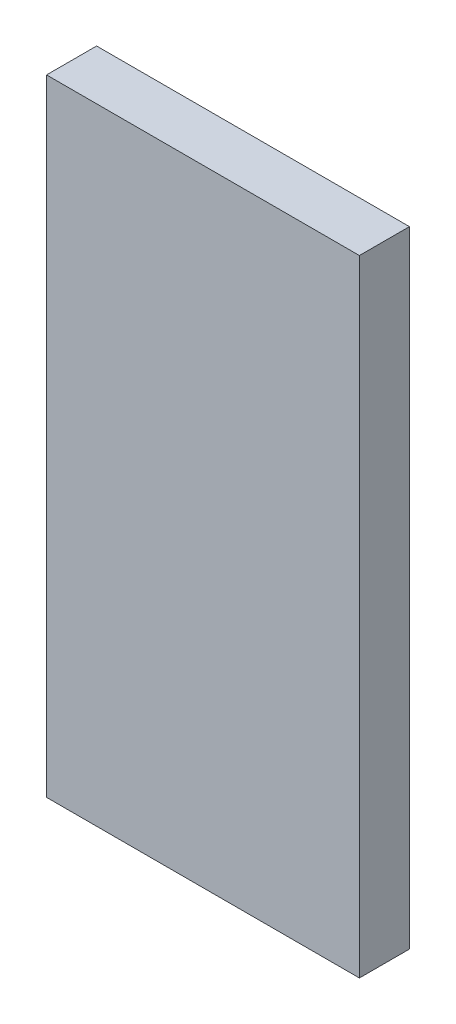
ISO-10303-21;
HEADER;
FILE_DESCRIPTION(('STEP AP214'),'2;1');
FILE_NAME('part.step','',(''),(''),'','','');
FILE_SCHEMA(('AUTOMOTIVE_DESIGN { 1 0 10303 214 1 1 1 1 }'));
ENDSEC;
DATA;
#1=APPLICATION_CONTEXT('core data for automotive mechanical design processes');
#2=APPLICATION_PROTOCOL_DEFINITION('international standard','automotive_design',2000,#1);
#3=PRODUCT_CONTEXT('',#1,'mechanical');
#4=PRODUCT('Part','Part','',(#3));
#5=PRODUCT_RELATED_PRODUCT_CATEGORY('part','',(#4));
#6=PRODUCT_DEFINITION_FORMATION('','',#4);
#7=PRODUCT_DEFINITION_CONTEXT('part definition',#1,'design');
#8=PRODUCT_DEFINITION('design','',#6,#7);
#9=PRODUCT_DEFINITION_SHAPE('','',#8);
#10=(LENGTH_UNIT() NAMED_UNIT(*) SI_UNIT(.MILLI.,.METRE.));
#11=(NAMED_UNIT(*) PLANE_ANGLE_UNIT() SI_UNIT($,.RADIAN.));
#12=(NAMED_UNIT(*) SI_UNIT($,.STERADIAN.) SOLID_ANGLE_UNIT());
#13=UNCERTAINTY_MEASURE_WITH_UNIT(LENGTH_MEASURE(1.E-05),#10,'distance_accuracy_value','');
#14=(GEOMETRIC_REPRESENTATION_CONTEXT(3) GLOBAL_UNCERTAINTY_ASSIGNED_CONTEXT((#13)) GLOBAL_UNIT_ASSIGNED_CONTEXT((#10,
#11,#12)) REPRESENTATION_CONTEXT('',''));
#15=CARTESIAN_POINT('',(0.,0.,0.));
#16=DIRECTION('',(0.,0.,1.));
#17=DIRECTION('',(1.,0.,0.));
#18=AXIS2_PLACEMENT_3D('',#15,#16,#17);
#19=CARTESIAN_POINT('',(2.5,5.00000000000001,0.8));
#20=DIRECTION('',(-1.,0.,0.));
#21=DIRECTION('',(0.,0.,1.));
#22=AXIS2_PLACEMENT_3D('',#19,#20,#21);
#23=PLANE('',#22);
#24=DIRECTION('',(0.,1.,0.));
#25=VECTOR('',#24,1.);
#26=CARTESIAN_POINT('',(2.5,5.00000000000001,0.));
#27=LINE('',#26,#25);
#28=CARTESIAN_POINT('',(2.5,-4.99999999999999,0.));
#29=VERTEX_POINT('',#28);
#30=CARTESIAN_POINT('',(2.5,5.00000000000001,0.));
#31=VERTEX_POINT('',#30);
#32=EDGE_CURVE('E100',#29,#31,#27,.T.);
#33=ORIENTED_EDGE('',*,*,#32,.T.);
#34=DIRECTION('',(0.,0.,-1.));
#35=VECTOR('',#34,1.);
#36=CARTESIAN_POINT('',(2.5,5.00000000000001,0.8));
#37=LINE('',#36,#35);
#38=CARTESIAN_POINT('',(2.5,5.00000000000001,0.8));
#39=VERTEX_POINT('',#38);
#40=EDGE_CURVE('E11',#39,#31,#37,.T.);
#41=ORIENTED_EDGE('',*,*,#40,.F.);
#42=DIRECTION('',(0.,1.,0.));
#43=VECTOR('',#42,1.);
#44=CARTESIAN_POINT('',(2.5,5.00000000000001,0.8));
#45=LINE('',#44,#43);
#46=CARTESIAN_POINT('',(2.5,-4.99999999999999,0.8));
#47=VERTEX_POINT('',#46);
#48=EDGE_CURVE('E88',#47,#39,#45,.T.);
#49=ORIENTED_EDGE('',*,*,#48,.F.);
#50=DIRECTION('',(0.,0.,-1.));
#51=VECTOR('',#50,1.);
#52=CARTESIAN_POINT('',(2.5,-4.99999999999999,0.8));
#53=LINE('',#52,#51);
#54=EDGE_CURVE('E96',#47,#29,#53,.T.);
#55=ORIENTED_EDGE('',*,*,#54,.T.);
#56=EDGE_LOOP('',(#33,#41,#49,#55));
#57=FACE_BOUND('',#56,.T.);
#58=ADVANCED_FACE('F37',(#57),#23,.F.);
#59=CARTESIAN_POINT('',(-2.50000000000001,5.00000000000001,0.8));
#60=DIRECTION('',(0.,-1.,0.));
#61=DIRECTION('',(0.,0.,-1.));
#62=AXIS2_PLACEMENT_3D('',#59,#60,#61);
#63=PLANE('',#62);
#64=DIRECTION('',(-1.,0.,0.));
#65=VECTOR('',#64,1.);
#66=CARTESIAN_POINT('',(-2.50000000000001,5.00000000000001,0.));
#67=LINE('',#66,#65);
#68=CARTESIAN_POINT('',(-2.50000000000001,5.00000000000001,0.));
#69=VERTEX_POINT('',#68);
#70=EDGE_CURVE('E92',#31,#69,#67,.T.);
#71=ORIENTED_EDGE('',*,*,#70,.T.);
#72=DIRECTION('',(0.,0.,-1.));
#73=VECTOR('',#72,1.);
#74=CARTESIAN_POINT('',(-2.50000000000001,5.00000000000001,0.8));
#75=LINE('',#74,#73);
#76=CARTESIAN_POINT('',(-2.50000000000001,5.00000000000001,0.8));
#77=VERTEX_POINT('',#76);
#78=EDGE_CURVE('E45',#77,#69,#75,.T.);
#79=ORIENTED_EDGE('',*,*,#78,.F.);
#80=DIRECTION('',(-1.,0.,0.));
#81=VECTOR('',#80,1.);
#82=CARTESIAN_POINT('',(-2.50000000000001,5.00000000000001,0.8));
#83=LINE('',#82,#81);
#84=EDGE_CURVE('E83',#39,#77,#83,.T.);
#85=ORIENTED_EDGE('',*,*,#84,.F.);
#86=ORIENTED_EDGE('',*,*,#40,.T.);
#87=EDGE_LOOP('',(#71,#79,#85,#86));
#88=FACE_BOUND('',#87,.T.);
#89=ADVANCED_FACE('F91',(#88),#63,.F.);
#90=CARTESIAN_POINT('',(-2.50000000000001,5.00000000000001,0.8));
#91=DIRECTION('',(1.,0.,0.));
#92=DIRECTION('',(0.,1.,0.));
#93=AXIS2_PLACEMENT_3D('',#90,#91,#92);
#94=PLANE('',#93);
#95=DIRECTION('',(0.,-1.,0.));
#96=VECTOR('',#95,1.);
#97=CARTESIAN_POINT('',(-2.50000000000001,5.00000000000001,0.));
#98=LINE('',#97,#96);
#99=CARTESIAN_POINT('',(-2.50000000000001,-4.99999999999999,0.));
#100=VERTEX_POINT('',#99);
#101=EDGE_CURVE('E70',#69,#100,#98,.T.);
#102=ORIENTED_EDGE('',*,*,#101,.T.);
#103=DIRECTION('',(0.,0.,-1.));
#104=VECTOR('',#103,1.);
#105=CARTESIAN_POINT('',(-2.50000000000001,-4.99999999999999,0.8));
#106=LINE('',#105,#104);
#107=CARTESIAN_POINT('',(-2.50000000000001,-4.99999999999999,0.8));
#108=VERTEX_POINT('',#107);
#109=EDGE_CURVE('E93',#108,#100,#106,.T.);
#110=ORIENTED_EDGE('',*,*,#109,.F.);
#111=DIRECTION('',(0.,-1.,0.));
#112=VECTOR('',#111,1.);
#113=CARTESIAN_POINT('',(-2.50000000000001,5.00000000000001,0.8));
#114=LINE('',#113,#112);
#115=EDGE_CURVE('E86',#77,#108,#114,.T.);
#116=ORIENTED_EDGE('',*,*,#115,.F.);
#117=ORIENTED_EDGE('',*,*,#78,.T.);
#118=EDGE_LOOP('',(#102,#110,#116,#117));
#119=FACE_BOUND('',#118,.T.);
#120=ADVANCED_FACE('F94',(#119),#94,.F.);
#121=CARTESIAN_POINT('',(-2.50000000000001,-4.99999999999999,0.8));
#122=DIRECTION('',(0.,1.,0.));
#123=DIRECTION('',(0.,0.,1.));
#124=AXIS2_PLACEMENT_3D('',#121,#122,#123);
#125=PLANE('',#124);
#126=DIRECTION('',(1.,0.,0.));
#127=VECTOR('',#126,1.);
#128=CARTESIAN_POINT('',(-2.50000000000001,-4.99999999999999,0.));
#129=LINE('',#128,#127);
#130=EDGE_CURVE('E76',#100,#29,#129,.T.);
#131=ORIENTED_EDGE('',*,*,#130,.T.);
#132=ORIENTED_EDGE('',*,*,#54,.F.);
#133=DIRECTION('',(1.,0.,0.));
#134=VECTOR('',#133,1.);
#135=CARTESIAN_POINT('',(-2.50000000000001,-4.99999999999999,0.8));
#136=LINE('',#135,#134);
#137=EDGE_CURVE('E53',#108,#47,#136,.T.);
#138=ORIENTED_EDGE('',*,*,#137,.F.);
#139=ORIENTED_EDGE('',*,*,#109,.T.);
#140=EDGE_LOOP('',(#131,#132,#138,#139));
#141=FACE_BOUND('',#140,.T.);
#142=ADVANCED_FACE('F107',(#141),#125,.F.);
#143=CARTESIAN_POINT('',(0.,0.,0.8));
#144=DIRECTION('',(0.,0.,1.));
#145=DIRECTION('',(1.,0.,0.));
#146=AXIS2_PLACEMENT_3D('',#143,#144,#145);
#147=PLANE('',#146);
#148=ORIENTED_EDGE('',*,*,#48,.T.);
#149=ORIENTED_EDGE('',*,*,#84,.T.);
#150=ORIENTED_EDGE('',*,*,#115,.T.);
#151=ORIENTED_EDGE('',*,*,#137,.T.);
#152=EDGE_LOOP('',(#148,#149,#150,#151));
#153=FACE_BOUND('',#152,.T.);
#154=ADVANCED_FACE('F84',(#153),#147,.T.);
#155=CARTESIAN_POINT('',(0.,0.,0.));
#156=DIRECTION('',(0.,0.,1.));
#157=DIRECTION('',(1.,0.,0.));
#158=AXIS2_PLACEMENT_3D('',#155,#156,#157);
#159=PLANE('',#158);
#160=ORIENTED_EDGE('',*,*,#32,.F.);
#161=ORIENTED_EDGE('',*,*,#130,.F.);
#162=ORIENTED_EDGE('',*,*,#101,.F.);
#163=ORIENTED_EDGE('',*,*,#70,.F.);
#164=EDGE_LOOP('',(#160,#161,#162,#163));
#165=FACE_BOUND('',#164,.T.);
#166=ADVANCED_FACE('F110',(#165),#159,.F.);
#167=CLOSED_SHELL('',(#58,#89,#120,#142,#154,#166));
#168=MANIFOLD_SOLID_BREP('B2',#167);
#169=ADVANCED_BREP_SHAPE_REPRESENTATION('',(#18,#168),#14);
#170=SHAPE_DEFINITION_REPRESENTATION(#9,#169);
ENDSEC;
END-ISO-10303-21;
